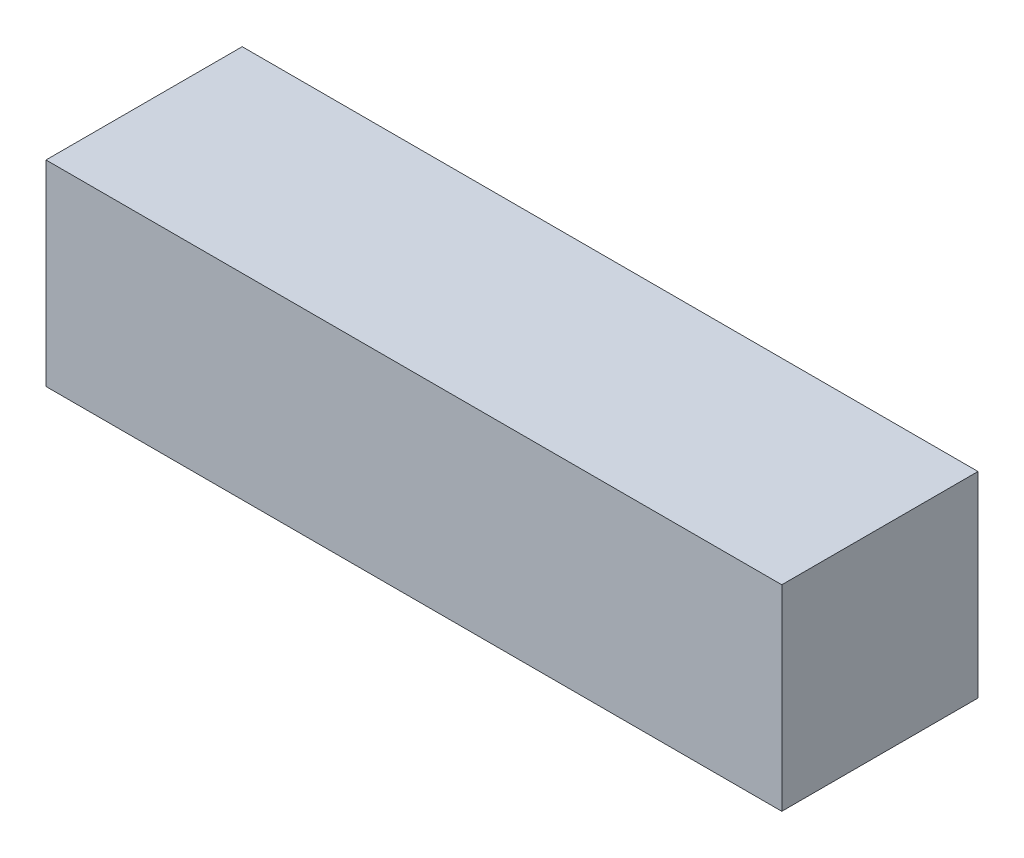
ISO-10303-21;
HEADER;
FILE_DESCRIPTION(('STEP AP214'),'2;1');
FILE_NAME('part.step','',(''),(''),'','','');
FILE_SCHEMA(('AUTOMOTIVE_DESIGN { 1 0 10303 214 1 1 1 1 }'));
ENDSEC;
DATA;
#1=APPLICATION_CONTEXT('core data for automotive mechanical design processes');
#2=APPLICATION_PROTOCOL_DEFINITION('international standard','automotive_design',2000,#1);
#3=PRODUCT_CONTEXT('',#1,'mechanical');
#4=PRODUCT('Part','Part','',(#3));
#5=PRODUCT_RELATED_PRODUCT_CATEGORY('part','',(#4));
#6=PRODUCT_DEFINITION_FORMATION('','',#4);
#7=PRODUCT_DEFINITION_CONTEXT('part definition',#1,'design');
#8=PRODUCT_DEFINITION('design','',#6,#7);
#9=PRODUCT_DEFINITION_SHAPE('','',#8);
#10=(LENGTH_UNIT() NAMED_UNIT(*) SI_UNIT(.MILLI.,.METRE.));
#11=(NAMED_UNIT(*) PLANE_ANGLE_UNIT() SI_UNIT($,.RADIAN.));
#12=(NAMED_UNIT(*) SI_UNIT($,.STERADIAN.) SOLID_ANGLE_UNIT());
#13=UNCERTAINTY_MEASURE_WITH_UNIT(LENGTH_MEASURE(1.E-05),#10,'distance_accuracy_value','');
#14=(GEOMETRIC_REPRESENTATION_CONTEXT(3) GLOBAL_UNCERTAINTY_ASSIGNED_CONTEXT((#13)) GLOBAL_UNIT_ASSIGNED_CONTEXT((#10,
#11,#12)) REPRESENTATION_CONTEXT('',''));
#15=CARTESIAN_POINT('',(0.,0.,0.));
#16=DIRECTION('',(0.,0.,1.));
#17=DIRECTION('',(1.,0.,0.));
#18=AXIS2_PLACEMENT_3D('',#15,#16,#17);
#19=CARTESIAN_POINT('',(-0.75,0.2,0.));
#20=DIRECTION('',(0.,0.,-1.));
#21=DIRECTION('',(-1.,0.,0.));
#22=AXIS2_PLACEMENT_3D('',#19,#20,#21);
#23=PLANE('',#22);
#24=DIRECTION('',(0.,1.,0.));
#25=VECTOR('',#24,1.);
#26=CARTESIAN_POINT('',(-2.25,0.2,0.));
#27=LINE('',#26,#25);
#28=CARTESIAN_POINT('',(-2.25,0.2,0.));
#29=VERTEX_POINT('',#28);
#30=CARTESIAN_POINT('',(-2.25,-0.2,0.));
#31=VERTEX_POINT('',#30);
#32=EDGE_CURVE('E20',#29,#31,#27,.F.);
#33=ORIENTED_EDGE('',*,*,#32,.F.);
#34=DIRECTION('',(1.,0.,0.));
#35=VECTOR('',#34,1.);
#36=CARTESIAN_POINT('',(-1.5,0.2,0.));
#37=LINE('',#36,#35);
#38=CARTESIAN_POINT('',(-0.75,0.2,0.));
#39=VERTEX_POINT('',#38);
#40=EDGE_CURVE('E80',#39,#29,#37,.F.);
#41=ORIENTED_EDGE('',*,*,#40,.F.);
#42=DIRECTION('',(0.,1.,0.));
#43=VECTOR('',#42,1.);
#44=CARTESIAN_POINT('',(-0.75,0.2,0.));
#45=LINE('',#44,#43);
#46=CARTESIAN_POINT('',(-0.75,-0.2,0.));
#47=VERTEX_POINT('',#46);
#48=EDGE_CURVE('E61',#47,#39,#45,.T.);
#49=ORIENTED_EDGE('',*,*,#48,.F.);
#50=DIRECTION('',(1.,0.,0.));
#51=VECTOR('',#50,1.);
#52=CARTESIAN_POINT('',(-1.5,-0.2,0.));
#53=LINE('',#52,#51);
#54=EDGE_CURVE('E55',#47,#31,#53,.F.);
#55=ORIENTED_EDGE('',*,*,#54,.T.);
#56=EDGE_LOOP('',(#33,#41,#49,#55));
#57=FACE_BOUND('',#56,.T.);
#58=ADVANCED_FACE('F17',(#57),#23,.T.);
#59=CARTESIAN_POINT('',(-2.25,0.2,0.));
#60=DIRECTION('',(-1.,0.,0.));
#61=DIRECTION('',(0.,0.,1.));
#62=AXIS2_PLACEMENT_3D('',#59,#60,#61);
#63=PLANE('',#62);
#64=DIRECTION('',(0.,1.,0.));
#65=VECTOR('',#64,1.);
#66=CARTESIAN_POINT('',(-2.25,0.2,0.4));
#67=LINE('',#66,#65);
#68=CARTESIAN_POINT('',(-2.25,0.2,0.4));
#69=VERTEX_POINT('',#68);
#70=CARTESIAN_POINT('',(-2.25,-0.2,0.4));
#71=VERTEX_POINT('',#70);
#72=EDGE_CURVE('E83',#69,#71,#67,.F.);
#73=ORIENTED_EDGE('',*,*,#72,.F.);
#74=DIRECTION('',(0.,0.,1.));
#75=VECTOR('',#74,1.);
#76=CARTESIAN_POINT('',(-2.25,0.2,0.2));
#77=LINE('',#76,#75);
#78=EDGE_CURVE('E68',#29,#69,#77,.T.);
#79=ORIENTED_EDGE('',*,*,#78,.F.);
#80=ORIENTED_EDGE('',*,*,#32,.T.);
#81=DIRECTION('',(0.,0.,1.));
#82=VECTOR('',#81,1.);
#83=CARTESIAN_POINT('',(-2.25,-0.2,0.2));
#84=LINE('',#83,#82);
#85=EDGE_CURVE('E63',#31,#71,#84,.T.);
#86=ORIENTED_EDGE('',*,*,#85,.T.);
#87=EDGE_LOOP('',(#73,#79,#80,#86));
#88=FACE_BOUND('',#87,.T.);
#89=ADVANCED_FACE('F65',(#88),#63,.T.);
#90=CARTESIAN_POINT('',(-1.5,-0.2,0.2));
#91=DIRECTION('',(0.,1.,0.));
#92=DIRECTION('',(0.,0.,1.));
#93=AXIS2_PLACEMENT_3D('',#90,#91,#92);
#94=PLANE('',#93);
#95=ORIENTED_EDGE('',*,*,#54,.F.);
#96=DIRECTION('',(0.,0.,-1.));
#97=VECTOR('',#96,1.);
#98=CARTESIAN_POINT('',(-0.75,-0.2,0.4));
#99=LINE('',#98,#97);
#100=CARTESIAN_POINT('',(-0.75,-0.2,0.4));
#101=VERTEX_POINT('',#100);
#102=EDGE_CURVE('E74',#101,#47,#99,.T.);
#103=ORIENTED_EDGE('',*,*,#102,.F.);
#104=DIRECTION('',(1.,0.,0.));
#105=VECTOR('',#104,1.);
#106=CARTESIAN_POINT('',(-2.25,-0.2,0.4));
#107=LINE('',#106,#105);
#108=EDGE_CURVE('E72',#71,#101,#107,.T.);
#109=ORIENTED_EDGE('',*,*,#108,.F.);
#110=ORIENTED_EDGE('',*,*,#85,.F.);
#111=EDGE_LOOP('',(#95,#103,#109,#110));
#112=FACE_BOUND('',#111,.T.);
#113=ADVANCED_FACE('F70',(#112),#94,.F.);
#114=CARTESIAN_POINT('',(-0.75,0.2,0.4));
#115=DIRECTION('',(1.,0.,0.));
#116=DIRECTION('',(0.,0.,-1.));
#117=AXIS2_PLACEMENT_3D('',#114,#115,#116);
#118=PLANE('',#117);
#119=ORIENTED_EDGE('',*,*,#48,.T.);
#120=DIRECTION('',(0.,0.,1.));
#121=VECTOR('',#120,1.);
#122=CARTESIAN_POINT('',(-0.75,0.2,0.2));
#123=LINE('',#122,#121);
#124=CARTESIAN_POINT('',(-0.75,0.2,0.4));
#125=VERTEX_POINT('',#124);
#126=EDGE_CURVE('E35',#125,#39,#123,.F.);
#127=ORIENTED_EDGE('',*,*,#126,.F.);
#128=DIRECTION('',(0.,1.,0.));
#129=VECTOR('',#128,1.);
#130=CARTESIAN_POINT('',(-0.75,0.2,0.4));
#131=LINE('',#130,#129);
#132=EDGE_CURVE('E26',#101,#125,#131,.T.);
#133=ORIENTED_EDGE('',*,*,#132,.F.);
#134=ORIENTED_EDGE('',*,*,#102,.T.);
#135=EDGE_LOOP('',(#119,#127,#133,#134));
#136=FACE_BOUND('',#135,.T.);
#137=ADVANCED_FACE('F89',(#136),#118,.T.);
#138=CARTESIAN_POINT('',(-1.5,0.2,0.2));
#139=DIRECTION('',(0.,1.,0.));
#140=DIRECTION('',(0.,0.,1.));
#141=AXIS2_PLACEMENT_3D('',#138,#139,#140);
#142=PLANE('',#141);
#143=ORIENTED_EDGE('',*,*,#40,.T.);
#144=ORIENTED_EDGE('',*,*,#78,.T.);
#145=DIRECTION('',(1.,0.,0.));
#146=VECTOR('',#145,1.);
#147=CARTESIAN_POINT('',(-2.25,0.2,0.4));
#148=LINE('',#147,#146);
#149=EDGE_CURVE('E11',#125,#69,#148,.F.);
#150=ORIENTED_EDGE('',*,*,#149,.F.);
#151=ORIENTED_EDGE('',*,*,#126,.T.);
#152=EDGE_LOOP('',(#143,#144,#150,#151));
#153=FACE_BOUND('',#152,.T.);
#154=ADVANCED_FACE('F91',(#153),#142,.T.);
#155=CARTESIAN_POINT('',(-2.25,0.2,0.4));
#156=DIRECTION('',(0.,0.,1.));
#157=DIRECTION('',(1.,0.,0.));
#158=AXIS2_PLACEMENT_3D('',#155,#156,#157);
#159=PLANE('',#158);
#160=ORIENTED_EDGE('',*,*,#132,.T.);
#161=ORIENTED_EDGE('',*,*,#149,.T.);
#162=ORIENTED_EDGE('',*,*,#72,.T.);
#163=ORIENTED_EDGE('',*,*,#108,.T.);
#164=EDGE_LOOP('',(#160,#161,#162,#163));
#165=FACE_BOUND('',#164,.T.);
#166=ADVANCED_FACE('F88',(#165),#159,.T.);
#167=CLOSED_SHELL('',(#58,#89,#113,#137,#154,#166));
#168=MANIFOLD_SOLID_BREP('B1',#167);
#169=ADVANCED_BREP_SHAPE_REPRESENTATION('',(#18,#168),#14);
#170=SHAPE_DEFINITION_REPRESENTATION(#9,#169);
ENDSEC;
END-ISO-10303-21;
